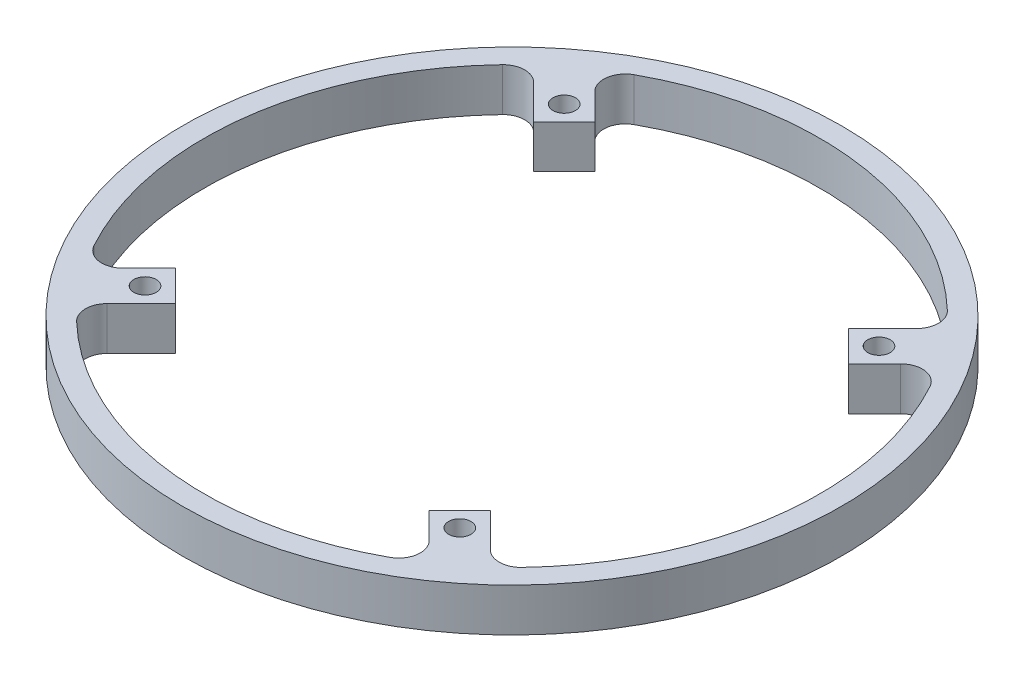
ISO-10303-21;
HEADER;
FILE_DESCRIPTION(('STEP AP214'),'2;1');
FILE_NAME('part.step','',(''),(''),'','','');
FILE_SCHEMA(('AUTOMOTIVE_DESIGN { 1 0 10303 214 1 1 1 1 }'));
ENDSEC;
DATA;
#1=APPLICATION_CONTEXT('core data for automotive mechanical design processes');
#2=APPLICATION_PROTOCOL_DEFINITION('international standard','automotive_design',2000,#1);
#3=PRODUCT_CONTEXT('',#1,'mechanical');
#4=PRODUCT('Part','Part','',(#3));
#5=PRODUCT_RELATED_PRODUCT_CATEGORY('part','',(#4));
#6=PRODUCT_DEFINITION_FORMATION('','',#4);
#7=PRODUCT_DEFINITION_CONTEXT('part definition',#1,'design');
#8=PRODUCT_DEFINITION('design','',#6,#7);
#9=PRODUCT_DEFINITION_SHAPE('','',#8);
#10=(LENGTH_UNIT() NAMED_UNIT(*) SI_UNIT(.MILLI.,.METRE.));
#11=(NAMED_UNIT(*) PLANE_ANGLE_UNIT() SI_UNIT($,.RADIAN.));
#12=(NAMED_UNIT(*) SI_UNIT($,.STERADIAN.) SOLID_ANGLE_UNIT());
#13=UNCERTAINTY_MEASURE_WITH_UNIT(LENGTH_MEASURE(1.E-05),#10,'distance_accuracy_value','');
#14=(GEOMETRIC_REPRESENTATION_CONTEXT(3) GLOBAL_UNCERTAINTY_ASSIGNED_CONTEXT((#13)) GLOBAL_UNIT_ASSIGNED_CONTEXT((#10,
#11,#12)) REPRESENTATION_CONTEXT('',''));
#15=CARTESIAN_POINT('',(0.,0.,0.));
#16=DIRECTION('',(0.,0.,1.));
#17=DIRECTION('',(1.,0.,0.));
#18=AXIS2_PLACEMENT_3D('',#15,#16,#17);
#19=CARTESIAN_POINT('',(0.,0.,55.));
#20=DIRECTION('',(0.,1.,0.));
#21=DIRECTION('',(0.,0.,1.));
#22=AXIS2_PLACEMENT_3D('',#19,#20,#21);
#23=PLANE('',#22);
#24=CARTESIAN_POINT('',(48.4619407771254,0.,-36.3908729652594));
#25=DIRECTION('',(0.,-1.,0.));
#26=DIRECTION('',(0.,0.,-1.));
#27=AXIS2_PLACEMENT_3D('',#24,#25,#26);
#28=CIRCLE('',#27,2.5908);
#29=CARTESIAN_POINT('',(48.4619407771254,0.,-38.9816729652594));
#30=VERTEX_POINT('',#29);
#31=EDGE_CURVE('E279',#30,#30,#28,.T.);
#32=ORIENTED_EDGE('',*,*,#31,.F.);
#33=EDGE_LOOP('',(#32));
#34=FACE_BOUND('',#33,.T.);
#35=CARTESIAN_POINT('',(36.3908729652589,0.,48.4619407771257));
#36=DIRECTION('',(0.,-1.,0.));
#37=DIRECTION('',(0.,0.,-1.));
#38=AXIS2_PLACEMENT_3D('',#35,#36,#37);
#39=CIRCLE('',#38,2.5908);
#40=CARTESIAN_POINT('',(36.3908729652589,0.,45.8711407771258));
#41=VERTEX_POINT('',#40);
#42=EDGE_CURVE('E287',#41,#41,#39,.T.);
#43=ORIENTED_EDGE('',*,*,#42,.F.);
#44=EDGE_LOOP('',(#43));
#45=FACE_BOUND('',#44,.T.);
#46=CARTESIAN_POINT('',(-48.4619407771256,0.,36.390872965259));
#47=DIRECTION('',(0.,-1.,0.));
#48=DIRECTION('',(0.,0.,-1.));
#49=AXIS2_PLACEMENT_3D('',#46,#47,#48);
#50=CIRCLE('',#49,2.5908);
#51=CARTESIAN_POINT('',(-48.4619407771256,0.,33.8000729652591));
#52=VERTEX_POINT('',#51);
#53=EDGE_CURVE('E293',#52,#52,#50,.T.);
#54=ORIENTED_EDGE('',*,*,#53,.F.);
#55=EDGE_LOOP('',(#54));
#56=FACE_BOUND('',#55,.T.);
#57=CARTESIAN_POINT('',(-36.3908729652589,0.,-48.4619407771257));
#58=DIRECTION('',(0.,-1.,0.));
#59=DIRECTION('',(0.,0.,-1.));
#60=AXIS2_PLACEMENT_3D('',#57,#58,#59);
#61=CIRCLE('',#60,2.5908);
#62=CARTESIAN_POINT('',(-36.3908729652589,0.,-51.0527407771257));
#63=VERTEX_POINT('',#62);
#64=EDGE_CURVE('E318',#63,#63,#61,.T.);
#65=ORIENTED_EDGE('',*,*,#64,.F.);
#66=EDGE_LOOP('',(#65));
#67=FACE_BOUND('',#66,.T.);
#68=DIRECTION('',(-0.707106781186548,0.,-0.707106781186547));
#69=VECTOR('',#68,1.);
#70=CARTESIAN_POINT('',(-48.4619407771257,0.,29.3198051533932));
#71=LINE('',#70,#69);
#72=CARTESIAN_POINT('',(-41.3908729652601,0.,36.3908729652589));
#73=VERTEX_POINT('',#72);
#74=CARTESIAN_POINT('',(-48.4619407771257,0.,29.3198051533932));
#75=VERTEX_POINT('',#74);
#76=EDGE_CURVE('E299',#73,#75,#71,.T.);
#77=ORIENTED_EDGE('',*,*,#76,.F.);
#78=DIRECTION('',(0.707106781186545,0.,-0.70710678118655));
#79=VECTOR('',#78,1.);
#80=CARTESIAN_POINT('',(-38.0707898487292,0.,33.0707898487282));
#81=LINE('',#80,#79);
#82=CARTESIAN_POINT('',(-49.2990135529554,0.,44.2990135529546));
#83=VERTEX_POINT('',#82);
#84=EDGE_CURVE('E261',#83,#73,#81,.T.);
#85=ORIENTED_EDGE('',*,*,#84,.F.);
#86=CARTESIAN_POINT('',(-45.7634796470227,0.,47.8345474588873));
#87=DIRECTION('',(0.,1.,0.));
#88=DIRECTION('',(0.,0.,1.));
#89=AXIS2_PLACEMENT_3D('',#86,#87,#88);
#90=CIRCLE('',#89,5.);
#91=CARTESIAN_POINT('',(-49.2199358137163,0.,51.4474286868999));
#92=VERTEX_POINT('',#91);
#93=EDGE_CURVE('E41',#83,#92,#90,.T.);
#94=ORIENTED_EDGE('',*,*,#93,.T.);
#95=CARTESIAN_POINT('',(0.,0.,0.));
#96=DIRECTION('',(0.,-1.,0.));
#97=DIRECTION('',(-1.,0.,0.));
#98=AXIS2_PLACEMENT_3D('',#95,#96,#97);
#99=CIRCLE('',#98,71.2);
#100=CARTESIAN_POINT('',(34.2357397747555,0.,62.4287924124376));
#101=VERTEX_POINT('',#100);
#102=EDGE_CURVE('E273',#101,#92,#99,.T.);
#103=ORIENTED_EDGE('',*,*,#102,.F.);
#104=CARTESIAN_POINT('',(31.8315445658541,0.,58.0447480014518));
#105=DIRECTION('',(0.,1.,0.));
#106=DIRECTION('',(0.,0.,1.));
#107=AXIS2_PLACEMENT_3D('',#104,#105,#106);
#108=CIRCLE('',#107,5.);
#109=CARTESIAN_POINT('',(35.3670784717868,0.,54.5092140955191));
#110=VERTEX_POINT('',#109);
#111=EDGE_CURVE('E370',#101,#110,#108,.T.);
#112=ORIENTED_EDGE('',*,*,#111,.T.);
#113=DIRECTION('',(0.707106781186549,0.,0.707106781186546));
#114=VECTOR('',#113,1.);
#115=CARTESIAN_POINT('',(39.8568055081611,0.,58.9989411318933));
#116=LINE('',#115,#114);
#117=CARTESIAN_POINT('',(29.3198051533934,0.,48.4619407771256));
#118=VERTEX_POINT('',#117);
#119=EDGE_CURVE('E270',#118,#110,#116,.T.);
#120=ORIENTED_EDGE('',*,*,#119,.F.);
#121=DIRECTION('',(-0.707106781186545,0.,0.70710678118655));
#122=VECTOR('',#121,1.);
#123=CARTESIAN_POINT('',(29.3198051533934,0.,48.4619407771256));
#124=LINE('',#123,#122);
#125=CARTESIAN_POINT('',(36.390872965259,0.,41.39087296526));
#126=VERTEX_POINT('',#125);
#127=EDGE_CURVE('E254',#126,#118,#124,.T.);
#128=ORIENTED_EDGE('',*,*,#127,.F.);
#129=DIRECTION('',(-0.707106781186547,0.,-0.707106781186548));
#130=VECTOR('',#129,1.);
#131=CARTESIAN_POINT('',(33.0707898487281,0.,38.0707898487293));
#132=LINE('',#131,#130);
#133=CARTESIAN_POINT('',(44.2990135529544,0.,49.2990135529556));
#134=VERTEX_POINT('',#133);
#135=EDGE_CURVE('E234',#134,#126,#132,.T.);
#136=ORIENTED_EDGE('',*,*,#135,.F.);
#137=CARTESIAN_POINT('',(47.8345474588871,0.,45.7634796470228));
#138=DIRECTION('',(0.,1.,0.));
#139=DIRECTION('',(0.,0.,1.));
#140=AXIS2_PLACEMENT_3D('',#137,#138,#139);
#141=CIRCLE('',#140,5.);
#142=CARTESIAN_POINT('',(51.4474286868998,0.,49.2199358137164));
#143=VERTEX_POINT('',#142);
#144=EDGE_CURVE('E386',#134,#143,#141,.T.);
#145=ORIENTED_EDGE('',*,*,#144,.T.);
#146=CARTESIAN_POINT('',(0.,0.,0.));
#147=DIRECTION('',(0.,-1.,0.));
#148=DIRECTION('',(0.,0.,1.));
#149=AXIS2_PLACEMENT_3D('',#146,#147,#148);
#150=CIRCLE('',#149,71.2);
#151=CARTESIAN_POINT('',(62.4287924124377,0.,-34.2357397747553));
#152=VERTEX_POINT('',#151);
#153=EDGE_CURVE('E248',#152,#143,#150,.T.);
#154=ORIENTED_EDGE('',*,*,#153,.F.);
#155=CARTESIAN_POINT('',(58.0447480014519,0.,-31.8315445658539));
#156=DIRECTION('',(0.,1.,0.));
#157=DIRECTION('',(0.,0.,1.));
#158=AXIS2_PLACEMENT_3D('',#155,#156,#157);
#159=CIRCLE('',#158,5.);
#160=CARTESIAN_POINT('',(54.5092140955192,0.,-35.3670784717866));
#161=VERTEX_POINT('',#160);
#162=EDGE_CURVE('E374',#152,#161,#159,.T.);
#163=ORIENTED_EDGE('',*,*,#162,.T.);
#164=DIRECTION('',(0.707106781186548,0.,-0.707106781186547));
#165=VECTOR('',#164,1.);
#166=CARTESIAN_POINT('',(58.9989411318935,0.,-39.8568055081609));
#167=LINE('',#166,#165);
#168=CARTESIAN_POINT('',(48.4619407771257,0.,-29.3198051533932));
#169=VERTEX_POINT('',#168);
#170=EDGE_CURVE('E245',#169,#161,#167,.T.);
#171=ORIENTED_EDGE('',*,*,#170,.F.);
#172=DIRECTION('',(0.707106781186548,0.,0.707106781186547));
#173=VECTOR('',#172,1.);
#174=CARTESIAN_POINT('',(48.4619407771257,0.,-29.3198051533932));
#175=LINE('',#174,#173);
#176=CARTESIAN_POINT('',(41.3908729652601,0.,-36.3908729652589));
#177=VERTEX_POINT('',#176);
#178=EDGE_CURVE('E224',#177,#169,#175,.T.);
#179=ORIENTED_EDGE('',*,*,#178,.F.);
#180=DIRECTION('',(-0.70710678118654,0.,0.707106781186555));
#181=VECTOR('',#180,1.);
#182=CARTESIAN_POINT('',(38.0707898487289,0.,-33.0707898487285));
#183=LINE('',#182,#181);
#184=CARTESIAN_POINT('',(49.2990135529551,0.,-44.2990135529549));
#185=VERTEX_POINT('',#184);
#186=EDGE_CURVE('E217',#185,#177,#183,.T.);
#187=ORIENTED_EDGE('',*,*,#186,.F.);
#188=CARTESIAN_POINT('',(45.7634796470224,0.,-47.8345474588876));
#189=DIRECTION('',(0.,1.,0.));
#190=DIRECTION('',(0.,0.,1.));
#191=AXIS2_PLACEMENT_3D('',#188,#189,#190);
#192=CIRCLE('',#191,5.);
#193=CARTESIAN_POINT('',(49.2199358137159,0.,-51.4474286869003));
#194=VERTEX_POINT('',#193);
#195=EDGE_CURVE('E393',#185,#194,#192,.T.);
#196=ORIENTED_EDGE('',*,*,#195,.T.);
#197=CARTESIAN_POINT('',(0.,0.,0.));
#198=DIRECTION('',(0.,-1.,0.));
#199=DIRECTION('',(1.,0.,0.));
#200=AXIS2_PLACEMENT_3D('',#197,#198,#199);
#201=CIRCLE('',#200,71.2);
#202=CARTESIAN_POINT('',(-34.2357397747559,0.,-62.4287924124374));
#203=VERTEX_POINT('',#202);
#204=EDGE_CURVE('E432',#203,#194,#201,.T.);
#205=ORIENTED_EDGE('',*,*,#204,.F.);
#206=CARTESIAN_POINT('',(-31.8315445658545,0.,-58.0447480014516));
#207=DIRECTION('',(0.,1.,0.));
#208=DIRECTION('',(0.,0.,1.));
#209=AXIS2_PLACEMENT_3D('',#206,#207,#208);
#210=CIRCLE('',#209,5.);
#211=CARTESIAN_POINT('',(-35.3670784717872,0.,-54.5092140955188));
#212=VERTEX_POINT('',#211);
#213=EDGE_CURVE('E378',#203,#212,#210,.T.);
#214=ORIENTED_EDGE('',*,*,#213,.T.);
#215=DIRECTION('',(-0.707106781186554,0.,-0.707106781186541));
#216=VECTOR('',#215,1.);
#217=CARTESIAN_POINT('',(-39.8568055081616,0.,-58.9989411318931));
#218=LINE('',#217,#216);
#219=CARTESIAN_POINT('',(-29.3198051533937,0.,-48.4619407771254));
#220=VERTEX_POINT('',#219);
#221=EDGE_CURVE('E430',#220,#212,#218,.T.);
#222=ORIENTED_EDGE('',*,*,#221,.F.);
#223=DIRECTION('',(0.70710678118654,0.,-0.707106781186555));
#224=VECTOR('',#223,1.);
#225=CARTESIAN_POINT('',(-29.3198051533937,0.,-48.4619407771254));
#226=LINE('',#225,#224);
#227=CARTESIAN_POINT('',(-36.3908729652593,0.,-41.3908729652597));
#228=VERTEX_POINT('',#227);
#229=EDGE_CURVE('E428',#228,#220,#226,.T.);
#230=ORIENTED_EDGE('',*,*,#229,.F.);
#231=DIRECTION('',(0.707106781186547,0.,0.707106781186548));
#232=VECTOR('',#231,1.);
#233=CARTESIAN_POINT('',(-33.0707898487281,0.,-38.0707898487293));
#234=LINE('',#233,#232);
#235=CARTESIAN_POINT('',(-44.2990135529544,0.,-49.2990135529556));
#236=VERTEX_POINT('',#235);
#237=EDGE_CURVE('E221',#236,#228,#234,.T.);
#238=ORIENTED_EDGE('',*,*,#237,.F.);
#239=CARTESIAN_POINT('',(-47.8345474588871,0.,-45.7634796470228));
#240=DIRECTION('',(0.,1.,0.));
#241=DIRECTION('',(0.,0.,1.));
#242=AXIS2_PLACEMENT_3D('',#239,#240,#241);
#243=CIRCLE('',#242,5.);
#244=CARTESIAN_POINT('',(-51.4474286868998,0.,-49.2199358137164));
#245=VERTEX_POINT('',#244);
#246=EDGE_CURVE('E390',#236,#245,#243,.T.);
#247=ORIENTED_EDGE('',*,*,#246,.T.);
#248=CARTESIAN_POINT('',(0.,0.,0.));
#249=DIRECTION('',(0.,-1.,0.));
#250=DIRECTION('',(0.,0.,-1.));
#251=AXIS2_PLACEMENT_3D('',#248,#249,#250);
#252=CIRCLE('',#251,71.2);
#253=CARTESIAN_POINT('',(-62.4287924124377,0.,34.2357397747553));
#254=VERTEX_POINT('',#253);
#255=EDGE_CURVE('E312',#254,#245,#252,.T.);
#256=ORIENTED_EDGE('',*,*,#255,.F.);
#257=CARTESIAN_POINT('',(-58.0447480014519,0.,31.8315445658539));
#258=DIRECTION('',(0.,1.,0.));
#259=DIRECTION('',(0.,0.,1.));
#260=AXIS2_PLACEMENT_3D('',#257,#258,#259);
#261=CIRCLE('',#260,5.);
#262=CARTESIAN_POINT('',(-54.5092140955192,0.,35.3670784717866));
#263=VERTEX_POINT('',#262);
#264=EDGE_CURVE('E382',#254,#263,#261,.T.);
#265=ORIENTED_EDGE('',*,*,#264,.T.);
#266=DIRECTION('',(-0.707106781186548,0.,0.707106781186547));
#267=VECTOR('',#266,1.);
#268=CARTESIAN_POINT('',(-58.9989411318935,0.,39.8568055081609));
#269=LINE('',#268,#267);
#270=EDGE_CURVE('E309',#75,#263,#269,.T.);
#271=ORIENTED_EDGE('',*,*,#270,.F.);
#272=EDGE_LOOP('',(#77,#85,#94,#103,#112,#120,#128,#136,#145,#154,#163,#171,#179,#187,#196,#205,
#214,#222,#230,#238,#247,#256,#265,#271));
#273=FACE_BOUND('',#272,.T.);
#274=CARTESIAN_POINT('',(0.,0.,0.));
#275=DIRECTION('',(0.,-1.,0.));
#276=DIRECTION('',(0.,0.,-1.));
#277=AXIS2_PLACEMENT_3D('',#274,#275,#276);
#278=CIRCLE('',#277,76.2);
#279=CARTESIAN_POINT('',(0.,0.,-76.2));
#280=VERTEX_POINT('',#279);
#281=EDGE_CURVE('E329',#280,#280,#278,.T.);
#282=ORIENTED_EDGE('',*,*,#281,.T.);
#283=EDGE_LOOP('',(#282));
#284=FACE_BOUND('',#283,.T.);
#285=ADVANCED_FACE('F33',(#34,#45,#56,#67,#273,#284),#23,.F.);
#286=CARTESIAN_POINT('',(0.,3.67892339833634,0.));
#287=DIRECTION('',(0.,-1.,0.));
#288=DIRECTION('',(0.,0.,-1.));
#289=AXIS2_PLACEMENT_3D('',#286,#287,#288);
#290=CYLINDRICAL_SURFACE('',#289,76.2);
#291=ORIENTED_EDGE('',*,*,#281,.F.);
#292=EDGE_LOOP('',(#291));
#293=FACE_BOUND('',#292,.T.);
#294=CARTESIAN_POINT('',(0.,9.99999999999999,0.));
#295=DIRECTION('',(0.,-1.,0.));
#296=DIRECTION('',(0.,0.,-1.));
#297=AXIS2_PLACEMENT_3D('',#294,#295,#296);
#298=CIRCLE('',#297,76.2);
#299=CARTESIAN_POINT('',(0.,9.99999999999999,-76.2));
#300=VERTEX_POINT('',#299);
#301=EDGE_CURVE('E326',#300,#300,#298,.T.);
#302=ORIENTED_EDGE('',*,*,#301,.T.);
#303=EDGE_LOOP('',(#302));
#304=FACE_BOUND('',#303,.T.);
#305=ADVANCED_FACE('F491',(#293,#304),#290,.T.);
#306=CARTESIAN_POINT('',(0.,9.99999999999999,76.2));
#307=DIRECTION('',(0.,-1.,0.));
#308=DIRECTION('',(0.,0.,-1.));
#309=AXIS2_PLACEMENT_3D('',#306,#307,#308);
#310=PLANE('',#309);
#311=CARTESIAN_POINT('',(48.4619407771254,9.99999999999999,-36.3908729652594));
#312=DIRECTION('',(0.,-1.,0.));
#313=DIRECTION('',(0.,0.,-1.));
#314=AXIS2_PLACEMENT_3D('',#311,#312,#313);
#315=CIRCLE('',#314,2.5908);
#316=CARTESIAN_POINT('',(48.4619407771254,9.99999999999999,-38.9816729652594));
#317=VERTEX_POINT('',#316);
#318=EDGE_CURVE('E284',#317,#317,#315,.T.);
#319=ORIENTED_EDGE('',*,*,#318,.T.);
#320=EDGE_LOOP('',(#319));
#321=FACE_BOUND('',#320,.T.);
#322=CARTESIAN_POINT('',(36.3908729652589,9.99999999999999,48.4619407771257));
#323=DIRECTION('',(0.,-1.,0.));
#324=DIRECTION('',(0.,0.,-1.));
#325=AXIS2_PLACEMENT_3D('',#322,#323,#324);
#326=CIRCLE('',#325,2.5908);
#327=CARTESIAN_POINT('',(36.3908729652589,9.99999999999999,45.8711407771258));
#328=VERTEX_POINT('',#327);
#329=EDGE_CURVE('E290',#328,#328,#326,.T.);
#330=ORIENTED_EDGE('',*,*,#329,.T.);
#331=EDGE_LOOP('',(#330));
#332=FACE_BOUND('',#331,.T.);
#333=CARTESIAN_POINT('',(-48.4619407771256,9.99999999999999,36.390872965259));
#334=DIRECTION('',(0.,-1.,0.));
#335=DIRECTION('',(0.,0.,-1.));
#336=AXIS2_PLACEMENT_3D('',#333,#334,#335);
#337=CIRCLE('',#336,2.5908);
#338=CARTESIAN_POINT('',(-48.4619407771256,9.99999999999999,33.8000729652591));
#339=VERTEX_POINT('',#338);
#340=EDGE_CURVE('E296',#339,#339,#337,.T.);
#341=ORIENTED_EDGE('',*,*,#340,.T.);
#342=EDGE_LOOP('',(#341));
#343=FACE_BOUND('',#342,.T.);
#344=CARTESIAN_POINT('',(-36.3908729652589,9.99999999999999,-48.4619407771257));
#345=DIRECTION('',(0.,-1.,0.));
#346=DIRECTION('',(0.,0.,-1.));
#347=AXIS2_PLACEMENT_3D('',#344,#345,#346);
#348=CIRCLE('',#347,2.5908);
#349=CARTESIAN_POINT('',(-36.3908729652589,9.99999999999999,-51.0527407771257));
#350=VERTEX_POINT('',#349);
#351=EDGE_CURVE('E323',#350,#350,#348,.T.);
#352=ORIENTED_EDGE('',*,*,#351,.T.);
#353=EDGE_LOOP('',(#352));
#354=FACE_BOUND('',#353,.T.);
#355=ORIENTED_EDGE('',*,*,#301,.F.);
#356=EDGE_LOOP('',(#355));
#357=FACE_BOUND('',#356,.T.);
#358=DIRECTION('',(0.70710678118655,0.,0.707106781186545));
#359=VECTOR('',#358,1.);
#360=CARTESIAN_POINT('',(36.3908729652591,9.99999999999999,55.5330085889913));
#361=LINE('',#360,#359);
#362=CARTESIAN_POINT('',(29.3198051533934,9.99999999999999,48.4619407771256));
#363=VERTEX_POINT('',#362);
#364=CARTESIAN_POINT('',(35.3670784717868,9.99999999999999,54.5092140955191));
#365=VERTEX_POINT('',#364);
#366=EDGE_CURVE('E260',#363,#365,#361,.T.);
#367=ORIENTED_EDGE('',*,*,#366,.T.);
#368=CARTESIAN_POINT('',(31.8315445658541,9.99999999999999,58.0447480014518));
#369=DIRECTION('',(0.,-1.,0.));
#370=DIRECTION('',(0.,0.,-1.));
#371=AXIS2_PLACEMENT_3D('',#368,#369,#370);
#372=CIRCLE('',#371,5.);
#373=CARTESIAN_POINT('',(34.2357397747555,9.99999999999999,62.4287924124376));
#374=VERTEX_POINT('',#373);
#375=EDGE_CURVE('E372',#365,#374,#372,.T.);
#376=ORIENTED_EDGE('',*,*,#375,.T.);
#377=CARTESIAN_POINT('',(0.,9.99999999999999,0.));
#378=DIRECTION('',(0.,-1.,0.));
#379=DIRECTION('',(-1.,0.,0.));
#380=AXIS2_PLACEMENT_3D('',#377,#378,#379);
#381=CIRCLE('',#380,71.2);
#382=CARTESIAN_POINT('',(-49.2199358137163,9.99999999999999,51.4474286868999));
#383=VERTEX_POINT('',#382);
#384=EDGE_CURVE('E263',#374,#383,#381,.T.);
#385=ORIENTED_EDGE('',*,*,#384,.T.);
#386=CARTESIAN_POINT('',(-45.7634796470227,9.99999999999999,47.8345474588873));
#387=DIRECTION('',(0.,-1.,0.));
#388=DIRECTION('',(0.,0.,-1.));
#389=AXIS2_PLACEMENT_3D('',#386,#387,#388);
#390=CIRCLE('',#389,5.);
#391=CARTESIAN_POINT('',(-49.2990135529554,9.99999999999999,44.2990135529546));
#392=VERTEX_POINT('',#391);
#393=EDGE_CURVE('E11',#383,#392,#390,.T.);
#394=ORIENTED_EDGE('',*,*,#393,.T.);
#395=DIRECTION('',(0.707106781186545,0.,-0.70710678118655));
#396=VECTOR('',#395,1.);
#397=CARTESIAN_POINT('',(-38.0707898487292,9.99999999999999,33.0707898487282));
#398=LINE('',#397,#396);
#399=CARTESIAN_POINT('',(-41.3908729652599,9.99999999999999,36.390872965259));
#400=VERTEX_POINT('',#399);
#401=EDGE_CURVE('E265',#392,#400,#398,.T.);
#402=ORIENTED_EDGE('',*,*,#401,.T.);
#403=DIRECTION('',(-0.707106781186548,0.,-0.707106781186547));
#404=VECTOR('',#403,1.);
#405=CARTESIAN_POINT('',(-48.4619407771257,9.99999999999999,29.3198051533932));
#406=LINE('',#405,#404);
#407=CARTESIAN_POINT('',(-48.4619407771257,9.99999999999999,29.3198051533932));
#408=VERTEX_POINT('',#407);
#409=EDGE_CURVE('E300',#400,#408,#406,.T.);
#410=ORIENTED_EDGE('',*,*,#409,.T.);
#411=DIRECTION('',(-0.707106781186548,0.,0.707106781186547));
#412=VECTOR('',#411,1.);
#413=CARTESIAN_POINT('',(-55.5330085889914,9.99999999999999,36.3908729652589));
#414=LINE('',#413,#412);
#415=CARTESIAN_POINT('',(-54.5092140955192,9.99999999999999,35.3670784717866));
#416=VERTEX_POINT('',#415);
#417=EDGE_CURVE('E303',#408,#416,#414,.T.);
#418=ORIENTED_EDGE('',*,*,#417,.T.);
#419=CARTESIAN_POINT('',(-58.0447480014519,9.99999999999999,31.8315445658539));
#420=DIRECTION('',(0.,-1.,0.));
#421=DIRECTION('',(0.,0.,-1.));
#422=AXIS2_PLACEMENT_3D('',#419,#420,#421);
#423=CIRCLE('',#422,5.);
#424=CARTESIAN_POINT('',(-62.4287924124377,9.99999999999999,34.2357397747553));
#425=VERTEX_POINT('',#424);
#426=EDGE_CURVE('E384',#416,#425,#423,.T.);
#427=ORIENTED_EDGE('',*,*,#426,.T.);
#428=CARTESIAN_POINT('',(0.,9.99999999999999,0.));
#429=DIRECTION('',(0.,-1.,0.));
#430=DIRECTION('',(0.,0.,-1.));
#431=AXIS2_PLACEMENT_3D('',#428,#429,#430);
#432=CIRCLE('',#431,71.2);
#433=CARTESIAN_POINT('',(-51.4474286868998,9.99999999999999,-49.2199358137164));
#434=VERTEX_POINT('',#433);
#435=EDGE_CURVE('E206',#425,#434,#432,.T.);
#436=ORIENTED_EDGE('',*,*,#435,.T.);
#437=CARTESIAN_POINT('',(-47.8345474588871,9.99999999999999,-45.7634796470228));
#438=DIRECTION('',(0.,-1.,0.));
#439=DIRECTION('',(0.,0.,-1.));
#440=AXIS2_PLACEMENT_3D('',#437,#438,#439);
#441=CIRCLE('',#440,5.);
#442=CARTESIAN_POINT('',(-44.2990135529544,9.99999999999999,-49.2990135529556));
#443=VERTEX_POINT('',#442);
#444=EDGE_CURVE('E200',#434,#443,#441,.T.);
#445=ORIENTED_EDGE('',*,*,#444,.T.);
#446=DIRECTION('',(0.707106781186547,0.,0.707106781186548));
#447=VECTOR('',#446,1.);
#448=CARTESIAN_POINT('',(-33.0707898487281,9.99999999999999,-38.0707898487293));
#449=LINE('',#448,#447);
#450=CARTESIAN_POINT('',(-36.3908729652593,9.99999999999999,-41.3908729652597));
#451=VERTEX_POINT('',#450);
#452=EDGE_CURVE('E192',#443,#451,#449,.T.);
#453=ORIENTED_EDGE('',*,*,#452,.T.);
#454=DIRECTION('',(0.70710678118654,0.,-0.707106781186555));
#455=VECTOR('',#454,1.);
#456=CARTESIAN_POINT('',(-29.3198051533937,9.99999999999999,-48.4619407771254));
#457=LINE('',#456,#455);
#458=CARTESIAN_POINT('',(-29.3198051533937,9.99999999999999,-48.4619407771254));
#459=VERTEX_POINT('',#458);
#460=EDGE_CURVE('E197',#451,#459,#457,.T.);
#461=ORIENTED_EDGE('',*,*,#460,.T.);
#462=DIRECTION('',(-0.707106781186555,0.,-0.70710678118654));
#463=VECTOR('',#462,1.);
#464=CARTESIAN_POINT('',(-36.3908729652595,9.99999999999999,-55.533008588991));
#465=LINE('',#464,#463);
#466=CARTESIAN_POINT('',(-35.3670784717872,9.99999999999999,-54.5092140955188));
#467=VERTEX_POINT('',#466);
#468=EDGE_CURVE('E216',#459,#467,#465,.T.);
#469=ORIENTED_EDGE('',*,*,#468,.T.);
#470=CARTESIAN_POINT('',(-31.8315445658545,9.99999999999999,-58.0447480014516));
#471=DIRECTION('',(0.,-1.,0.));
#472=DIRECTION('',(0.,0.,-1.));
#473=AXIS2_PLACEMENT_3D('',#470,#471,#472);
#474=CIRCLE('',#473,5.);
#475=CARTESIAN_POINT('',(-34.2357397747559,9.99999999999999,-62.4287924124374));
#476=VERTEX_POINT('',#475);
#477=EDGE_CURVE('E380',#467,#476,#474,.T.);
#478=ORIENTED_EDGE('',*,*,#477,.T.);
#479=CARTESIAN_POINT('',(0.,9.99999999999999,0.));
#480=DIRECTION('',(0.,-1.,0.));
#481=DIRECTION('',(1.,0.,0.));
#482=AXIS2_PLACEMENT_3D('',#479,#480,#481);
#483=CIRCLE('',#482,71.2);
#484=CARTESIAN_POINT('',(49.2199358137159,9.99999999999999,-51.4474286869003));
#485=VERTEX_POINT('',#484);
#486=EDGE_CURVE('E226',#476,#485,#483,.T.);
#487=ORIENTED_EDGE('',*,*,#486,.T.);
#488=CARTESIAN_POINT('',(45.7634796470224,9.99999999999999,-47.8345474588876));
#489=DIRECTION('',(0.,-1.,0.));
#490=DIRECTION('',(0.,0.,-1.));
#491=AXIS2_PLACEMENT_3D('',#488,#489,#490);
#492=CIRCLE('',#491,5.);
#493=CARTESIAN_POINT('',(49.2990135529551,9.99999999999999,-44.2990135529549));
#494=VERTEX_POINT('',#493);
#495=EDGE_CURVE('E395',#485,#494,#492,.T.);
#496=ORIENTED_EDGE('',*,*,#495,.T.);
#497=DIRECTION('',(-0.70710678118654,0.,0.707106781186555));
#498=VECTOR('',#497,1.);
#499=CARTESIAN_POINT('',(38.0707898487289,9.99999999999999,-33.0707898487285));
#500=LINE('',#499,#498);
#501=CARTESIAN_POINT('',(41.3908729652597,9.99999999999999,-36.3908729652593));
#502=VERTEX_POINT('',#501);
#503=EDGE_CURVE('E222',#494,#502,#500,.T.);
#504=ORIENTED_EDGE('',*,*,#503,.T.);
#505=DIRECTION('',(0.707106781186548,0.,0.707106781186547));
#506=VECTOR('',#505,1.);
#507=CARTESIAN_POINT('',(48.4619407771257,9.99999999999999,-29.3198051533932));
#508=LINE('',#507,#506);
#509=CARTESIAN_POINT('',(48.4619407771257,9.99999999999999,-29.3198051533932));
#510=VERTEX_POINT('',#509);
#511=EDGE_CURVE('E230',#502,#510,#508,.T.);
#512=ORIENTED_EDGE('',*,*,#511,.T.);
#513=DIRECTION('',(0.707106781186548,0.,-0.707106781186547));
#514=VECTOR('',#513,1.);
#515=CARTESIAN_POINT('',(55.5330085889914,9.99999999999999,-36.3908729652589));
#516=LINE('',#515,#514);
#517=CARTESIAN_POINT('',(54.5092140955192,9.99999999999999,-35.3670784717866));
#518=VERTEX_POINT('',#517);
#519=EDGE_CURVE('E233',#510,#518,#516,.T.);
#520=ORIENTED_EDGE('',*,*,#519,.T.);
#521=CARTESIAN_POINT('',(58.0447480014519,9.99999999999999,-31.8315445658539));
#522=DIRECTION('',(0.,-1.,0.));
#523=DIRECTION('',(0.,0.,-1.));
#524=AXIS2_PLACEMENT_3D('',#521,#522,#523);
#525=CIRCLE('',#524,5.);
#526=CARTESIAN_POINT('',(62.4287924124377,9.99999999999999,-34.2357397747553));
#527=VERTEX_POINT('',#526);
#528=EDGE_CURVE('E376',#518,#527,#525,.T.);
#529=ORIENTED_EDGE('',*,*,#528,.T.);
#530=CARTESIAN_POINT('',(0.,9.99999999999999,0.));
#531=DIRECTION('',(0.,-1.,0.));
#532=DIRECTION('',(0.,0.,1.));
#533=AXIS2_PLACEMENT_3D('',#530,#531,#532);
#534=CIRCLE('',#533,71.2);
#535=CARTESIAN_POINT('',(51.4474286868998,9.99999999999999,49.2199358137164));
#536=VERTEX_POINT('',#535);
#537=EDGE_CURVE('E237',#527,#536,#534,.T.);
#538=ORIENTED_EDGE('',*,*,#537,.T.);
#539=CARTESIAN_POINT('',(47.8345474588871,9.99999999999999,45.7634796470228));
#540=DIRECTION('',(0.,-1.,0.));
#541=DIRECTION('',(0.,0.,-1.));
#542=AXIS2_PLACEMENT_3D('',#539,#540,#541);
#543=CIRCLE('',#542,5.);
#544=CARTESIAN_POINT('',(44.2990135529544,9.99999999999999,49.2990135529556));
#545=VERTEX_POINT('',#544);
#546=EDGE_CURVE('E388',#536,#545,#543,.T.);
#547=ORIENTED_EDGE('',*,*,#546,.T.);
#548=DIRECTION('',(-0.707106781186547,0.,-0.707106781186548));
#549=VECTOR('',#548,1.);
#550=CARTESIAN_POINT('',(33.0707898487281,9.99999999999999,38.0707898487293));
#551=LINE('',#550,#549);
#552=CARTESIAN_POINT('',(36.3908729652589,9.99999999999999,41.3908729652601));
#553=VERTEX_POINT('',#552);
#554=EDGE_CURVE('E240',#545,#553,#551,.T.);
#555=ORIENTED_EDGE('',*,*,#554,.T.);
#556=DIRECTION('',(-0.707106781186545,0.,0.70710678118655));
#557=VECTOR('',#556,1.);
#558=CARTESIAN_POINT('',(29.3198051533934,9.99999999999999,48.4619407771256));
#559=LINE('',#558,#557);
#560=EDGE_CURVE('E257',#553,#363,#559,.T.);
#561=ORIENTED_EDGE('',*,*,#560,.T.);
#562=EDGE_LOOP('',(#367,#376,#385,#394,#402,#410,#418,#427,#436,#445,#453,#461,#469,#478,#487,
#496,#504,#512,#520,#529,#538,#547,#555,#561));
#563=FACE_BOUND('',#562,.T.);
#564=ADVANCED_FACE('F195',(#321,#332,#343,#354,#357,#563),#310,.F.);
#565=CARTESIAN_POINT('',(-36.3908729652589,0.,-48.4619407771257));
#566=DIRECTION('',(0.,-1.,0.));
#567=DIRECTION('',(0.,0.,-1.));
#568=AXIS2_PLACEMENT_3D('',#565,#566,#567);
#569=CYLINDRICAL_SURFACE('',#568,2.5908);
#570=ORIENTED_EDGE('',*,*,#351,.F.);
#571=EDGE_LOOP('',(#570));
#572=FACE_BOUND('',#571,.T.);
#573=ORIENTED_EDGE('',*,*,#64,.T.);
#574=EDGE_LOOP('',(#573));
#575=FACE_BOUND('',#574,.T.);
#576=ADVANCED_FACE('F575',(#572,#575),#569,.F.);
#577=CARTESIAN_POINT('',(-33.0707898487281,9.99999999999999,-38.0707898487293));
#578=DIRECTION('',(0.707106781186548,0.,-0.707106781186547));
#579=DIRECTION('',(-0.707106781186547,0.,-0.707106781186548));
#580=AXIS2_PLACEMENT_3D('',#577,#578,#579);
#581=PLANE('',#580);
#582=ORIENTED_EDGE('',*,*,#452,.F.);
#583=DIRECTION('',(0.,1.,0.));
#584=VECTOR('',#583,1.);
#585=CARTESIAN_POINT('',(-44.2990135529544,0.,-49.2990135529556));
#586=LINE('',#585,#584);
#587=EDGE_CURVE('E363',#443,#236,#586,.F.);
#588=ORIENTED_EDGE('',*,*,#587,.T.);
#589=ORIENTED_EDGE('',*,*,#237,.T.);
#590=DIRECTION('',(0.,-1.,0.));
#591=VECTOR('',#590,1.);
#592=CARTESIAN_POINT('',(-36.3908729652593,9.99999999999999,-41.3908729652597));
#593=LINE('',#592,#591);
#594=EDGE_CURVE('E212',#451,#228,#593,.T.);
#595=ORIENTED_EDGE('',*,*,#594,.F.);
#596=EDGE_LOOP('',(#582,#588,#589,#595));
#597=FACE_BOUND('',#596,.T.);
#598=ADVANCED_FACE('F219',(#597),#581,.F.);
#599=CARTESIAN_POINT('',(0.,9.99999999999999,0.));
#600=DIRECTION('',(0.,-1.,0.));
#601=DIRECTION('',(0.,0.,-1.));
#602=AXIS2_PLACEMENT_3D('',#599,#600,#601);
#603=CYLINDRICAL_SURFACE('',#602,71.2);
#604=ORIENTED_EDGE('',*,*,#435,.F.);
#605=DIRECTION('',(0.,-1.,0.));
#606=VECTOR('',#605,1.);
#607=CARTESIAN_POINT('',(-62.4287924124377,9.99999999999999,34.2357397747553));
#608=LINE('',#607,#606);
#609=EDGE_CURVE('E355',#425,#254,#608,.T.);
#610=ORIENTED_EDGE('',*,*,#609,.T.);
#611=ORIENTED_EDGE('',*,*,#255,.T.);
#612=DIRECTION('',(0.,-1.,0.));
#613=VECTOR('',#612,1.);
#614=CARTESIAN_POINT('',(-51.4474286868998,9.99999999999999,-49.2199358137164));
#615=LINE('',#614,#613);
#616=EDGE_CURVE('E353',#245,#434,#615,.F.);
#617=ORIENTED_EDGE('',*,*,#616,.T.);
#618=EDGE_LOOP('',(#604,#610,#611,#617));
#619=FACE_BOUND('',#618,.T.);
#620=ADVANCED_FACE('F422',(#619),#603,.F.);
#621=CARTESIAN_POINT('',(-58.9989411318935,9.99999999999999,39.8568055081609));
#622=DIRECTION('',(0.707106781186547,0.,0.707106781186548));
#623=DIRECTION('',(0.707106781186548,0.,-0.707106781186547));
#624=AXIS2_PLACEMENT_3D('',#621,#622,#623);
#625=PLANE('',#624);
#626=ORIENTED_EDGE('',*,*,#270,.T.);
#627=DIRECTION('',(0.,1.,0.));
#628=VECTOR('',#627,1.);
#629=CARTESIAN_POINT('',(-54.5092140955192,9.99999999999999,35.3670784717866));
#630=LINE('',#629,#628);
#631=EDGE_CURVE('E358',#263,#416,#630,.T.);
#632=ORIENTED_EDGE('',*,*,#631,.T.);
#633=ORIENTED_EDGE('',*,*,#417,.F.);
#634=DIRECTION('',(0.,-1.,0.));
#635=VECTOR('',#634,1.);
#636=CARTESIAN_POINT('',(-48.4619407771257,9.99999999999999,29.3198051533932));
#637=LINE('',#636,#635);
#638=EDGE_CURVE('E316',#408,#75,#637,.T.);
#639=ORIENTED_EDGE('',*,*,#638,.T.);
#640=EDGE_LOOP('',(#626,#632,#633,#639));
#641=FACE_BOUND('',#640,.T.);
#642=ADVANCED_FACE('F415',(#641),#625,.F.);
#643=CARTESIAN_POINT('',(-48.4619407771257,9.99999999999999,29.3198051533932));
#644=DIRECTION('',(-0.707106781186547,0.,0.707106781186548));
#645=DIRECTION('',(0.707106781186548,0.,0.707106781186547));
#646=AXIS2_PLACEMENT_3D('',#643,#644,#645);
#647=PLANE('',#646);
#648=ORIENTED_EDGE('',*,*,#76,.T.);
#649=ORIENTED_EDGE('',*,*,#638,.F.);
#650=ORIENTED_EDGE('',*,*,#409,.F.);
#651=DIRECTION('',(0.,-1.,0.));
#652=VECTOR('',#651,1.);
#653=CARTESIAN_POINT('',(-41.3908729652601,9.99999999999999,36.3908729652589));
#654=LINE('',#653,#652);
#655=EDGE_CURVE('E205',#400,#73,#654,.T.);
#656=ORIENTED_EDGE('',*,*,#655,.T.);
#657=EDGE_LOOP('',(#648,#649,#650,#656));
#658=FACE_BOUND('',#657,.T.);
#659=ADVANCED_FACE('F412',(#658),#647,.F.);
#660=CARTESIAN_POINT('',(-48.4619407771256,0.,36.390872965259));
#661=DIRECTION('',(0.,-1.,0.));
#662=DIRECTION('',(0.,0.,-1.));
#663=AXIS2_PLACEMENT_3D('',#660,#661,#662);
#664=CYLINDRICAL_SURFACE('',#663,2.5908);
#665=ORIENTED_EDGE('',*,*,#340,.F.);
#666=EDGE_LOOP('',(#665));
#667=FACE_BOUND('',#666,.T.);
#668=ORIENTED_EDGE('',*,*,#53,.T.);
#669=EDGE_LOOP('',(#668));
#670=FACE_BOUND('',#669,.T.);
#671=ADVANCED_FACE('F564',(#667,#670),#664,.F.);
#672=CARTESIAN_POINT('',(36.3908729652589,0.,48.4619407771257));
#673=DIRECTION('',(0.,-1.,0.));
#674=DIRECTION('',(0.,0.,-1.));
#675=AXIS2_PLACEMENT_3D('',#672,#673,#674);
#676=CYLINDRICAL_SURFACE('',#675,2.5908);
#677=ORIENTED_EDGE('',*,*,#329,.F.);
#678=EDGE_LOOP('',(#677));
#679=FACE_BOUND('',#678,.T.);
#680=ORIENTED_EDGE('',*,*,#42,.T.);
#681=EDGE_LOOP('',(#680));
#682=FACE_BOUND('',#681,.T.);
#683=ADVANCED_FACE('F558',(#679,#682),#676,.F.);
#684=CARTESIAN_POINT('',(48.4619407771254,0.,-36.3908729652594));
#685=DIRECTION('',(0.,-1.,0.));
#686=DIRECTION('',(0.,0.,-1.));
#687=AXIS2_PLACEMENT_3D('',#684,#685,#686);
#688=CYLINDRICAL_SURFACE('',#687,2.5908);
#689=ORIENTED_EDGE('',*,*,#318,.F.);
#690=EDGE_LOOP('',(#689));
#691=FACE_BOUND('',#690,.T.);
#692=ORIENTED_EDGE('',*,*,#31,.T.);
#693=EDGE_LOOP('',(#692));
#694=FACE_BOUND('',#693,.T.);
#695=ADVANCED_FACE('F554',(#691,#694),#688,.F.);
#696=CARTESIAN_POINT('',(-38.0707898487292,9.99999999999999,33.0707898487282));
#697=DIRECTION('',(-0.70710678118655,0.,-0.707106781186545));
#698=DIRECTION('',(-0.707106781186545,0.,0.70710678118655));
#699=AXIS2_PLACEMENT_3D('',#696,#697,#698);
#700=PLANE('',#699);
#701=ORIENTED_EDGE('',*,*,#401,.F.);
#702=DIRECTION('',(0.,1.,0.));
#703=VECTOR('',#702,1.);
#704=CARTESIAN_POINT('',(-49.2990135529554,0.,44.2990135529546));
#705=LINE('',#704,#703);
#706=EDGE_CURVE('E368',#392,#83,#705,.F.);
#707=ORIENTED_EDGE('',*,*,#706,.T.);
#708=ORIENTED_EDGE('',*,*,#84,.T.);
#709=ORIENTED_EDGE('',*,*,#655,.F.);
#710=EDGE_LOOP('',(#701,#707,#708,#709));
#711=FACE_BOUND('',#710,.T.);
#712=ADVANCED_FACE('F406',(#711),#700,.F.);
#713=CARTESIAN_POINT('',(0.,9.99999999999999,0.));
#714=DIRECTION('',(0.,-1.,0.));
#715=DIRECTION('',(0.,0.,-1.));
#716=AXIS2_PLACEMENT_3D('',#713,#714,#715);
#717=CYLINDRICAL_SURFACE('',#716,71.2);
#718=ORIENTED_EDGE('',*,*,#384,.F.);
#719=DIRECTION('',(0.,-1.,0.));
#720=VECTOR('',#719,1.);
#721=CARTESIAN_POINT('',(34.2357397747555,9.99999999999999,62.4287924124376));
#722=LINE('',#721,#720);
#723=EDGE_CURVE('E334',#374,#101,#722,.T.);
#724=ORIENTED_EDGE('',*,*,#723,.T.);
#725=ORIENTED_EDGE('',*,*,#102,.T.);
#726=DIRECTION('',(0.,-1.,0.));
#727=VECTOR('',#726,1.);
#728=CARTESIAN_POINT('',(-49.2199358137163,9.99999999999999,51.4474286868999));
#729=LINE('',#728,#727);
#730=EDGE_CURVE('E332',#92,#383,#729,.F.);
#731=ORIENTED_EDGE('',*,*,#730,.T.);
#732=EDGE_LOOP('',(#718,#724,#725,#731));
#733=FACE_BOUND('',#732,.T.);
#734=ADVANCED_FACE('F403',(#733),#717,.F.);
#735=CARTESIAN_POINT('',(39.8568055081611,9.99999999999999,58.9989411318933));
#736=DIRECTION('',(0.707106781186546,0.,-0.707106781186549));
#737=DIRECTION('',(-0.707106781186549,0.,-0.707106781186546));
#738=AXIS2_PLACEMENT_3D('',#735,#736,#737);
#739=PLANE('',#738);
#740=ORIENTED_EDGE('',*,*,#119,.T.);
#741=DIRECTION('',(0.,1.,0.));
#742=VECTOR('',#741,1.);
#743=CARTESIAN_POINT('',(35.3670784717868,9.99999999999999,54.5092140955191));
#744=LINE('',#743,#742);
#745=EDGE_CURVE('E337',#110,#365,#744,.T.);
#746=ORIENTED_EDGE('',*,*,#745,.T.);
#747=ORIENTED_EDGE('',*,*,#366,.F.);
#748=DIRECTION('',(0.,-1.,0.));
#749=VECTOR('',#748,1.);
#750=CARTESIAN_POINT('',(29.3198051533934,9.99999999999999,48.4619407771256));
#751=LINE('',#750,#749);
#752=EDGE_CURVE('E277',#363,#118,#751,.T.);
#753=ORIENTED_EDGE('',*,*,#752,.T.);
#754=EDGE_LOOP('',(#740,#746,#747,#753));
#755=FACE_BOUND('',#754,.T.);
#756=ADVANCED_FACE('F481',(#755),#739,.F.);
#757=CARTESIAN_POINT('',(29.3198051533934,9.99999999999999,48.4619407771256));
#758=DIRECTION('',(0.70710678118655,0.,0.707106781186545));
#759=DIRECTION('',(0.707106781186545,0.,-0.70710678118655));
#760=AXIS2_PLACEMENT_3D('',#757,#758,#759);
#761=PLANE('',#760);
#762=ORIENTED_EDGE('',*,*,#127,.T.);
#763=ORIENTED_EDGE('',*,*,#752,.F.);
#764=ORIENTED_EDGE('',*,*,#560,.F.);
#765=DIRECTION('',(0.,-1.,0.));
#766=VECTOR('',#765,1.);
#767=CARTESIAN_POINT('',(36.390872965259,9.99999999999999,41.39087296526));
#768=LINE('',#767,#766);
#769=EDGE_CURVE('E267',#553,#126,#768,.T.);
#770=ORIENTED_EDGE('',*,*,#769,.T.);
#771=EDGE_LOOP('',(#762,#763,#764,#770));
#772=FACE_BOUND('',#771,.T.);
#773=ADVANCED_FACE('F473',(#772),#761,.F.);
#774=CARTESIAN_POINT('',(33.0707898487281,9.99999999999999,38.0707898487293));
#775=DIRECTION('',(-0.707106781186548,0.,0.707106781186547));
#776=DIRECTION('',(0.707106781186547,0.,0.707106781186548));
#777=AXIS2_PLACEMENT_3D('',#774,#775,#776);
#778=PLANE('',#777);
#779=ORIENTED_EDGE('',*,*,#554,.F.);
#780=DIRECTION('',(0.,1.,0.));
#781=VECTOR('',#780,1.);
#782=CARTESIAN_POINT('',(44.2990135529544,0.,49.2990135529556));
#783=LINE('',#782,#781);
#784=EDGE_CURVE('E360',#545,#134,#783,.F.);
#785=ORIENTED_EDGE('',*,*,#784,.T.);
#786=ORIENTED_EDGE('',*,*,#135,.T.);
#787=ORIENTED_EDGE('',*,*,#769,.F.);
#788=EDGE_LOOP('',(#779,#785,#786,#787));
#789=FACE_BOUND('',#788,.T.);
#790=ADVANCED_FACE('F468',(#789),#778,.F.);
#791=CARTESIAN_POINT('',(0.,9.99999999999999,0.));
#792=DIRECTION('',(0.,-1.,0.));
#793=DIRECTION('',(0.,0.,-1.));
#794=AXIS2_PLACEMENT_3D('',#791,#792,#793);
#795=CYLINDRICAL_SURFACE('',#794,71.2);
#796=ORIENTED_EDGE('',*,*,#537,.F.);
#797=DIRECTION('',(0.,-1.,0.));
#798=VECTOR('',#797,1.);
#799=CARTESIAN_POINT('',(62.4287924124377,9.99999999999999,-34.2357397747553));
#800=LINE('',#799,#798);
#801=EDGE_CURVE('E341',#527,#152,#800,.T.);
#802=ORIENTED_EDGE('',*,*,#801,.T.);
#803=ORIENTED_EDGE('',*,*,#153,.T.);
#804=DIRECTION('',(0.,-1.,0.));
#805=VECTOR('',#804,1.);
#806=CARTESIAN_POINT('',(51.4474286868998,9.99999999999999,49.2199358137164));
#807=LINE('',#806,#805);
#808=EDGE_CURVE('E339',#143,#536,#807,.F.);
#809=ORIENTED_EDGE('',*,*,#808,.T.);
#810=EDGE_LOOP('',(#796,#802,#803,#809));
#811=FACE_BOUND('',#810,.T.);
#812=ADVANCED_FACE('F460',(#811),#795,.F.);
#813=CARTESIAN_POINT('',(58.9989411318935,9.99999999999999,-39.8568055081609));
#814=DIRECTION('',(-0.707106781186547,0.,-0.707106781186548));
#815=DIRECTION('',(-0.707106781186548,0.,0.707106781186547));
#816=AXIS2_PLACEMENT_3D('',#813,#814,#815);
#817=PLANE('',#816);
#818=ORIENTED_EDGE('',*,*,#170,.T.);
#819=DIRECTION('',(0.,1.,0.));
#820=VECTOR('',#819,1.);
#821=CARTESIAN_POINT('',(54.5092140955192,9.99999999999999,-35.3670784717866));
#822=LINE('',#821,#820);
#823=EDGE_CURVE('E344',#161,#518,#822,.T.);
#824=ORIENTED_EDGE('',*,*,#823,.T.);
#825=ORIENTED_EDGE('',*,*,#519,.F.);
#826=DIRECTION('',(0.,-1.,0.));
#827=VECTOR('',#826,1.);
#828=CARTESIAN_POINT('',(48.4619407771257,9.99999999999999,-29.3198051533932));
#829=LINE('',#828,#827);
#830=EDGE_CURVE('E252',#510,#169,#829,.T.);
#831=ORIENTED_EDGE('',*,*,#830,.T.);
#832=EDGE_LOOP('',(#818,#824,#825,#831));
#833=FACE_BOUND('',#832,.T.);
#834=ADVANCED_FACE('F451',(#833),#817,.F.);
#835=CARTESIAN_POINT('',(48.4619407771257,9.99999999999999,-29.3198051533932));
#836=DIRECTION('',(0.707106781186547,0.,-0.707106781186548));
#837=DIRECTION('',(-0.707106781186548,0.,-0.707106781186547));
#838=AXIS2_PLACEMENT_3D('',#835,#836,#837);
#839=PLANE('',#838);
#840=ORIENTED_EDGE('',*,*,#178,.T.);
#841=ORIENTED_EDGE('',*,*,#830,.F.);
#842=ORIENTED_EDGE('',*,*,#511,.F.);
#843=DIRECTION('',(0.,-1.,0.));
#844=VECTOR('',#843,1.);
#845=CARTESIAN_POINT('',(41.3908729652601,9.99999999999999,-36.3908729652589));
#846=LINE('',#845,#844);
#847=EDGE_CURVE('E242',#502,#177,#846,.T.);
#848=ORIENTED_EDGE('',*,*,#847,.T.);
#849=EDGE_LOOP('',(#840,#841,#842,#848));
#850=FACE_BOUND('',#849,.T.);
#851=ADVANCED_FACE('F446',(#850),#839,.F.);
#852=CARTESIAN_POINT('',(38.0707898487289,9.99999999999999,-33.0707898487285));
#853=DIRECTION('',(0.707106781186555,0.,0.70710678118654));
#854=DIRECTION('',(0.70710678118654,0.,-0.707106781186555));
#855=AXIS2_PLACEMENT_3D('',#852,#853,#854);
#856=PLANE('',#855);
#857=ORIENTED_EDGE('',*,*,#503,.F.);
#858=DIRECTION('',(0.,1.,0.));
#859=VECTOR('',#858,1.);
#860=CARTESIAN_POINT('',(49.2990135529551,0.,-44.2990135529549));
#861=LINE('',#860,#859);
#862=EDGE_CURVE('E365',#494,#185,#861,.F.);
#863=ORIENTED_EDGE('',*,*,#862,.T.);
#864=ORIENTED_EDGE('',*,*,#186,.T.);
#865=ORIENTED_EDGE('',*,*,#847,.F.);
#866=EDGE_LOOP('',(#857,#863,#864,#865));
#867=FACE_BOUND('',#866,.T.);
#868=ADVANCED_FACE('F441',(#867),#856,.F.);
#869=CARTESIAN_POINT('',(0.,9.99999999999999,0.));
#870=DIRECTION('',(0.,-1.,0.));
#871=DIRECTION('',(0.,0.,-1.));
#872=AXIS2_PLACEMENT_3D('',#869,#870,#871);
#873=CYLINDRICAL_SURFACE('',#872,71.2);
#874=ORIENTED_EDGE('',*,*,#486,.F.);
#875=DIRECTION('',(0.,-1.,0.));
#876=VECTOR('',#875,1.);
#877=CARTESIAN_POINT('',(-34.2357397747559,9.99999999999999,-62.4287924124374));
#878=LINE('',#877,#876);
#879=EDGE_CURVE('E348',#476,#203,#878,.T.);
#880=ORIENTED_EDGE('',*,*,#879,.T.);
#881=ORIENTED_EDGE('',*,*,#204,.T.);
#882=DIRECTION('',(0.,-1.,0.));
#883=VECTOR('',#882,1.);
#884=CARTESIAN_POINT('',(49.2199358137159,9.99999999999999,-51.4474286869003));
#885=LINE('',#884,#883);
#886=EDGE_CURVE('E346',#194,#485,#885,.F.);
#887=ORIENTED_EDGE('',*,*,#886,.T.);
#888=EDGE_LOOP('',(#874,#880,#881,#887));
#889=FACE_BOUND('',#888,.T.);
#890=ADVANCED_FACE('F533',(#889),#873,.F.);
#891=CARTESIAN_POINT('',(-39.8568055081616,9.99999999999999,-58.9989411318931));
#892=DIRECTION('',(-0.707106781186541,0.,0.707106781186554));
#893=DIRECTION('',(0.707106781186554,0.,0.707106781186541));
#894=AXIS2_PLACEMENT_3D('',#891,#892,#893);
#895=PLANE('',#894);
#896=ORIENTED_EDGE('',*,*,#221,.T.);
#897=DIRECTION('',(0.,1.,0.));
#898=VECTOR('',#897,1.);
#899=CARTESIAN_POINT('',(-35.3670784717872,9.99999999999999,-54.5092140955188));
#900=LINE('',#899,#898);
#901=EDGE_CURVE('E351',#212,#467,#900,.T.);
#902=ORIENTED_EDGE('',*,*,#901,.T.);
#903=ORIENTED_EDGE('',*,*,#468,.F.);
#904=DIRECTION('',(0.,-1.,0.));
#905=VECTOR('',#904,1.);
#906=CARTESIAN_POINT('',(-29.3198051533937,9.99999999999999,-48.4619407771254));
#907=LINE('',#906,#905);
#908=EDGE_CURVE('E214',#459,#220,#907,.T.);
#909=ORIENTED_EDGE('',*,*,#908,.T.);
#910=EDGE_LOOP('',(#896,#902,#903,#909));
#911=FACE_BOUND('',#910,.T.);
#912=ADVANCED_FACE('F534',(#911),#895,.F.);
#913=CARTESIAN_POINT('',(-29.3198051533937,9.99999999999999,-48.4619407771254));
#914=DIRECTION('',(-0.707106781186555,0.,-0.70710678118654));
#915=DIRECTION('',(-0.70710678118654,0.,0.707106781186555));
#916=AXIS2_PLACEMENT_3D('',#913,#914,#915);
#917=PLANE('',#916);
#918=ORIENTED_EDGE('',*,*,#229,.T.);
#919=ORIENTED_EDGE('',*,*,#908,.F.);
#920=ORIENTED_EDGE('',*,*,#460,.F.);
#921=ORIENTED_EDGE('',*,*,#594,.T.);
#922=EDGE_LOOP('',(#918,#919,#920,#921));
#923=FACE_BOUND('',#922,.T.);
#924=ADVANCED_FACE('F211',(#923),#917,.F.);
#925=CARTESIAN_POINT('',(31.8315445658541,9.99999999999999,58.0447480014518));
#926=DIRECTION('',(0.,-1.,0.));
#927=DIRECTION('',(0.,0.,-1.));
#928=AXIS2_PLACEMENT_3D('',#925,#926,#927);
#929=CYLINDRICAL_SURFACE('',#928,5.);
#930=ORIENTED_EDGE('',*,*,#375,.F.);
#931=ORIENTED_EDGE('',*,*,#745,.F.);
#932=ORIENTED_EDGE('',*,*,#111,.F.);
#933=ORIENTED_EDGE('',*,*,#723,.F.);
#934=EDGE_LOOP('',(#930,#931,#932,#933));
#935=FACE_BOUND('',#934,.T.);
#936=ADVANCED_FACE('F479',(#935),#929,.F.);
#937=CARTESIAN_POINT('',(58.0447480014519,9.99999999999999,-31.8315445658539));
#938=DIRECTION('',(0.,-1.,0.));
#939=DIRECTION('',(0.,0.,-1.));
#940=AXIS2_PLACEMENT_3D('',#937,#938,#939);
#941=CYLINDRICAL_SURFACE('',#940,5.);
#942=ORIENTED_EDGE('',*,*,#528,.F.);
#943=ORIENTED_EDGE('',*,*,#823,.F.);
#944=ORIENTED_EDGE('',*,*,#162,.F.);
#945=ORIENTED_EDGE('',*,*,#801,.F.);
#946=EDGE_LOOP('',(#942,#943,#944,#945));
#947=FACE_BOUND('',#946,.T.);
#948=ADVANCED_FACE('F455',(#947),#941,.F.);
#949=CARTESIAN_POINT('',(-31.8315445658545,9.99999999999999,-58.0447480014516));
#950=DIRECTION('',(0.,-1.,0.));
#951=DIRECTION('',(0.,0.,-1.));
#952=AXIS2_PLACEMENT_3D('',#949,#950,#951);
#953=CYLINDRICAL_SURFACE('',#952,5.);
#954=ORIENTED_EDGE('',*,*,#477,.F.);
#955=ORIENTED_EDGE('',*,*,#901,.F.);
#956=ORIENTED_EDGE('',*,*,#213,.F.);
#957=ORIENTED_EDGE('',*,*,#879,.F.);
#958=EDGE_LOOP('',(#954,#955,#956,#957));
#959=FACE_BOUND('',#958,.T.);
#960=ADVANCED_FACE('F507',(#959),#953,.F.);
#961=CARTESIAN_POINT('',(-58.0447480014519,9.99999999999999,31.8315445658539));
#962=DIRECTION('',(0.,-1.,0.));
#963=DIRECTION('',(0.,0.,-1.));
#964=AXIS2_PLACEMENT_3D('',#961,#962,#963);
#965=CYLINDRICAL_SURFACE('',#964,5.);
#966=ORIENTED_EDGE('',*,*,#426,.F.);
#967=ORIENTED_EDGE('',*,*,#631,.F.);
#968=ORIENTED_EDGE('',*,*,#264,.F.);
#969=ORIENTED_EDGE('',*,*,#609,.F.);
#970=EDGE_LOOP('',(#966,#967,#968,#969));
#971=FACE_BOUND('',#970,.T.);
#972=ADVANCED_FACE('F418',(#971),#965,.F.);
#973=CARTESIAN_POINT('',(47.8345474588871,9.99999999999999,45.7634796470228));
#974=DIRECTION('',(0.,-1.,0.));
#975=DIRECTION('',(0.,0.,-1.));
#976=AXIS2_PLACEMENT_3D('',#973,#974,#975);
#977=CYLINDRICAL_SURFACE('',#976,5.);
#978=ORIENTED_EDGE('',*,*,#546,.F.);
#979=ORIENTED_EDGE('',*,*,#808,.F.);
#980=ORIENTED_EDGE('',*,*,#144,.F.);
#981=ORIENTED_EDGE('',*,*,#784,.F.);
#982=EDGE_LOOP('',(#978,#979,#980,#981));
#983=FACE_BOUND('',#982,.T.);
#984=ADVANCED_FACE('F463',(#983),#977,.F.);
#985=CARTESIAN_POINT('',(-47.8345474588871,9.99999999999999,-45.7634796470228));
#986=DIRECTION('',(0.,-1.,0.));
#987=DIRECTION('',(0.,0.,-1.));
#988=AXIS2_PLACEMENT_3D('',#985,#986,#987);
#989=CYLINDRICAL_SURFACE('',#988,5.);
#990=ORIENTED_EDGE('',*,*,#444,.F.);
#991=ORIENTED_EDGE('',*,*,#616,.F.);
#992=ORIENTED_EDGE('',*,*,#246,.F.);
#993=ORIENTED_EDGE('',*,*,#587,.F.);
#994=EDGE_LOOP('',(#990,#991,#992,#993));
#995=FACE_BOUND('',#994,.T.);
#996=ADVANCED_FACE('F426',(#995),#989,.F.);
#997=CARTESIAN_POINT('',(45.7634796470224,9.99999999999999,-47.8345474588876));
#998=DIRECTION('',(0.,-1.,0.));
#999=DIRECTION('',(0.,0.,-1.));
#1000=AXIS2_PLACEMENT_3D('',#997,#998,#999);
#1001=CYLINDRICAL_SURFACE('',#1000,5.);
#1002=ORIENTED_EDGE('',*,*,#495,.F.);
#1003=ORIENTED_EDGE('',*,*,#886,.F.);
#1004=ORIENTED_EDGE('',*,*,#195,.F.);
#1005=ORIENTED_EDGE('',*,*,#862,.F.);
#1006=EDGE_LOOP('',(#1002,#1003,#1004,#1005));
#1007=FACE_BOUND('',#1006,.T.);
#1008=ADVANCED_FACE('F516',(#1007),#1001,.F.);
#1009=CARTESIAN_POINT('',(-45.7634796470227,9.99999999999999,47.8345474588873));
#1010=DIRECTION('',(0.,-1.,0.));
#1011=DIRECTION('',(0.,0.,-1.));
#1012=AXIS2_PLACEMENT_3D('',#1009,#1010,#1011);
#1013=CYLINDRICAL_SURFACE('',#1012,5.);
#1014=ORIENTED_EDGE('',*,*,#393,.F.);
#1015=ORIENTED_EDGE('',*,*,#730,.F.);
#1016=ORIENTED_EDGE('',*,*,#93,.F.);
#1017=ORIENTED_EDGE('',*,*,#706,.F.);
#1018=EDGE_LOOP('',(#1014,#1015,#1016,#1017));
#1019=FACE_BOUND('',#1018,.T.);
#1020=ADVANCED_FACE('F35',(#1019),#1013,.F.);
#1021=CLOSED_SHELL('',(#285,#305,#564,#576,#598,#620,#642,#659,#671,#683,#695,#712,#734,#756,
#773,#790,#812,#834,#851,#868,#890,#912,#924,#936,#948,#960,#972,#984,#996,#1008,#1020));
#1022=MANIFOLD_SOLID_BREP('B2',#1021);
#1023=ADVANCED_BREP_SHAPE_REPRESENTATION('',(#18,#1022),#14);
#1024=SHAPE_DEFINITION_REPRESENTATION(#9,#1023);
ENDSEC;
END-ISO-10303-21;
